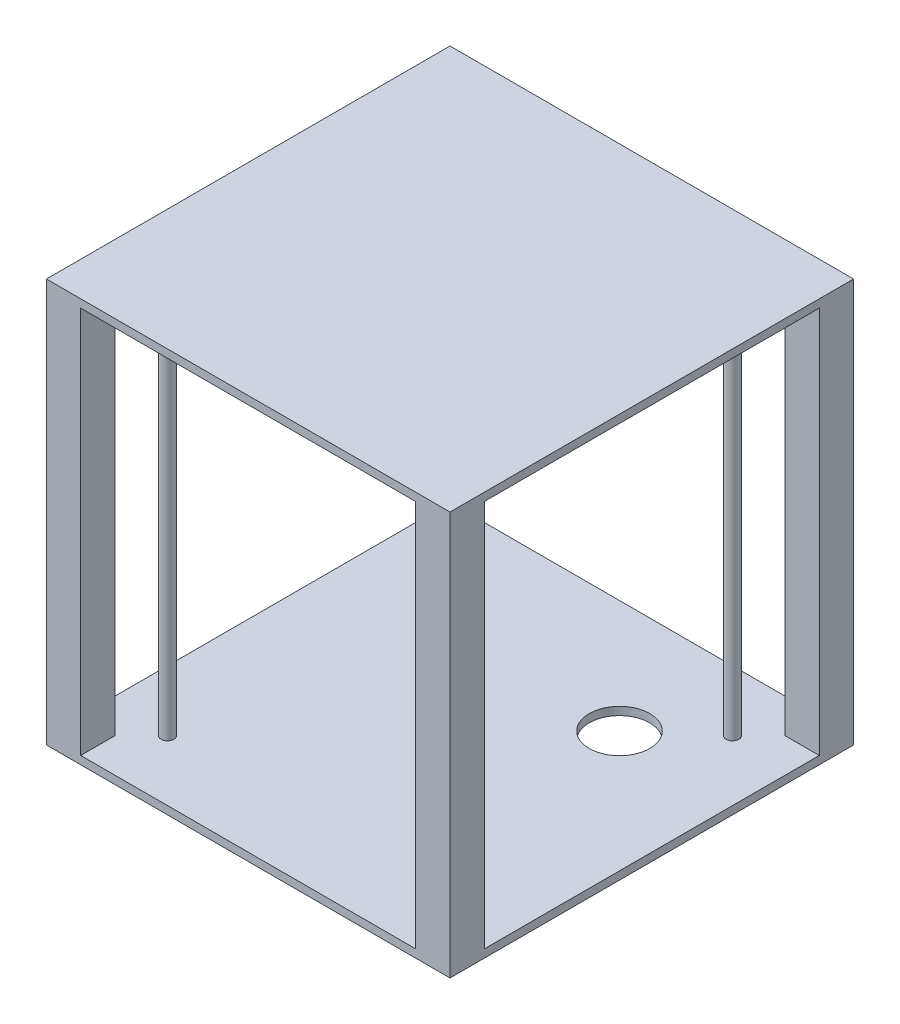
ISO-10303-21;
HEADER;
FILE_DESCRIPTION(('STEP AP214'),'2;1');
FILE_NAME('part.step','',(''),(''),'','','');
FILE_SCHEMA(('AUTOMOTIVE_DESIGN { 1 0 10303 214 1 1 1 1 }'));
ENDSEC;
DATA;
#1=APPLICATION_CONTEXT('core data for automotive mechanical design processes');
#2=APPLICATION_PROTOCOL_DEFINITION('international standard','automotive_design',2000,#1);
#3=PRODUCT_CONTEXT('',#1,'mechanical');
#4=PRODUCT('Part','Part','',(#3));
#5=PRODUCT_RELATED_PRODUCT_CATEGORY('part','',(#4));
#6=PRODUCT_DEFINITION_FORMATION('','',#4);
#7=PRODUCT_DEFINITION_CONTEXT('part definition',#1,'design');
#8=PRODUCT_DEFINITION('design','',#6,#7);
#9=PRODUCT_DEFINITION_SHAPE('','',#8);
#10=(LENGTH_UNIT() NAMED_UNIT(*) SI_UNIT(.MILLI.,.METRE.));
#11=(NAMED_UNIT(*) PLANE_ANGLE_UNIT() SI_UNIT($,.RADIAN.));
#12=(NAMED_UNIT(*) SI_UNIT($,.STERADIAN.) SOLID_ANGLE_UNIT());
#13=UNCERTAINTY_MEASURE_WITH_UNIT(LENGTH_MEASURE(1.E-05),#10,'distance_accuracy_value','');
#14=(GEOMETRIC_REPRESENTATION_CONTEXT(3) GLOBAL_UNCERTAINTY_ASSIGNED_CONTEXT((#13)) GLOBAL_UNIT_ASSIGNED_CONTEXT((#10,
#11,#12)) REPRESENTATION_CONTEXT('',''));
#15=CARTESIAN_POINT('',(0.,0.,0.));
#16=DIRECTION('',(0.,0.,1.));
#17=DIRECTION('',(1.,0.,0.));
#18=AXIS2_PLACEMENT_3D('',#15,#16,#17);
#19=CARTESIAN_POINT('',(0.,2.,0.));
#20=DIRECTION('',(0.,-1.,0.));
#21=DIRECTION('',(0.,0.,-1.));
#22=AXIS2_PLACEMENT_3D('',#19,#20,#21);
#23=PLANE('',#22);
#24=CARTESIAN_POINT('',(70.,2.,-72.));
#25=DIRECTION('',(0.,1.,0.));
#26=DIRECTION('',(0.,0.,1.));
#27=AXIS2_PLACEMENT_3D('',#24,#25,#26);
#28=CIRCLE('',#27,7.5);
#29=CARTESIAN_POINT('',(70.,2.,-64.5));
#30=VERTEX_POINT('',#29);
#31=EDGE_CURVE('E509',#30,#30,#28,.T.);
#32=ORIENTED_EDGE('',*,*,#31,.F.);
#33=EDGE_LOOP('',(#32));
#34=FACE_BOUND('',#33,.T.);
#35=CARTESIAN_POINT('',(85.,2.,-85.));
#36=DIRECTION('',(0.,-1.,0.));
#37=DIRECTION('',(0.,0.,-1.));
#38=AXIS2_PLACEMENT_3D('',#35,#36,#37);
#39=CIRCLE('',#38,1.575);
#40=CARTESIAN_POINT('',(85.,2.,-86.575));
#41=VERTEX_POINT('',#40);
#42=EDGE_CURVE('E372',#41,#41,#39,.F.);
#43=ORIENTED_EDGE('',*,*,#42,.F.);
#44=EDGE_LOOP('',(#43));
#45=FACE_BOUND('',#44,.T.);
#46=CARTESIAN_POINT('',(15.,2.,-85.));
#47=DIRECTION('',(0.,-1.,0.));
#48=DIRECTION('',(0.,0.,-1.));
#49=AXIS2_PLACEMENT_3D('',#46,#47,#48);
#50=CIRCLE('',#49,1.575);
#51=CARTESIAN_POINT('',(15.,2.,-86.575));
#52=VERTEX_POINT('',#51);
#53=EDGE_CURVE('E157',#52,#52,#50,.F.);
#54=ORIENTED_EDGE('',*,*,#53,.F.);
#55=EDGE_LOOP('',(#54));
#56=FACE_BOUND('',#55,.T.);
#57=DIRECTION('',(0.,0.,1.));
#58=VECTOR('',#57,1.);
#59=CARTESIAN_POINT('',(91.5,2.,-91.5));
#60=LINE('',#59,#58);
#61=CARTESIAN_POINT('',(91.5,2.,-100.));
#62=VERTEX_POINT('',#61);
#63=CARTESIAN_POINT('',(91.5,2.,-91.5));
#64=VERTEX_POINT('',#63);
#65=EDGE_CURVE('E184',#62,#64,#60,.T.);
#66=ORIENTED_EDGE('',*,*,#65,.F.);
#67=DIRECTION('',(-1.,0.,0.));
#68=VECTOR('',#67,1.);
#69=CARTESIAN_POINT('',(0.,2.,-100.));
#70=LINE('',#69,#68);
#71=CARTESIAN_POINT('',(8.5,2.,-100.));
#72=VERTEX_POINT('',#71);
#73=EDGE_CURVE('E326',#62,#72,#70,.T.);
#74=ORIENTED_EDGE('',*,*,#73,.T.);
#75=DIRECTION('',(0.,0.,-1.));
#76=VECTOR('',#75,1.);
#77=CARTESIAN_POINT('',(8.5,2.,-91.5));
#78=LINE('',#77,#76);
#79=CARTESIAN_POINT('',(8.5,2.,-91.5));
#80=VERTEX_POINT('',#79);
#81=EDGE_CURVE('E215',#80,#72,#78,.T.);
#82=ORIENTED_EDGE('',*,*,#81,.F.);
#83=DIRECTION('',(1.,0.,0.));
#84=VECTOR('',#83,1.);
#85=CARTESIAN_POINT('',(0.,2.,-91.5));
#86=LINE('',#85,#84);
#87=CARTESIAN_POINT('',(0.,2.,-91.5));
#88=VERTEX_POINT('',#87);
#89=EDGE_CURVE('E210',#88,#80,#86,.T.);
#90=ORIENTED_EDGE('',*,*,#89,.F.);
#91=DIRECTION('',(0.,0.,1.));
#92=VECTOR('',#91,1.);
#93=CARTESIAN_POINT('',(0.,2.,0.));
#94=LINE('',#93,#92);
#95=CARTESIAN_POINT('',(0.,2.,-8.5));
#96=VERTEX_POINT('',#95);
#97=EDGE_CURVE('E275',#88,#96,#94,.T.);
#98=ORIENTED_EDGE('',*,*,#97,.T.);
#99=DIRECTION('',(-1.,0.,0.));
#100=VECTOR('',#99,1.);
#101=CARTESIAN_POINT('',(0.,2.,-8.5));
#102=LINE('',#101,#100);
#103=CARTESIAN_POINT('',(8.5,2.,-8.5));
#104=VERTEX_POINT('',#103);
#105=EDGE_CURVE('E257',#104,#96,#102,.T.);
#106=ORIENTED_EDGE('',*,*,#105,.F.);
#107=DIRECTION('',(0.,0.,-1.));
#108=VECTOR('',#107,1.);
#109=CARTESIAN_POINT('',(8.5,2.,0.));
#110=LINE('',#109,#108);
#111=CARTESIAN_POINT('',(8.5,2.,0.));
#112=VERTEX_POINT('',#111);
#113=EDGE_CURVE('E252',#112,#104,#110,.T.);
#114=ORIENTED_EDGE('',*,*,#113,.F.);
#115=DIRECTION('',(1.,0.,0.));
#116=VECTOR('',#115,1.);
#117=CARTESIAN_POINT('',(0.,2.,0.));
#118=LINE('',#117,#116);
#119=CARTESIAN_POINT('',(91.5,2.,0.));
#120=VERTEX_POINT('',#119);
#121=EDGE_CURVE('E277',#112,#120,#118,.T.);
#122=ORIENTED_EDGE('',*,*,#121,.T.);
#123=DIRECTION('',(0.,0.,1.));
#124=VECTOR('',#123,1.);
#125=CARTESIAN_POINT('',(91.5,2.,0.));
#126=LINE('',#125,#124);
#127=CARTESIAN_POINT('',(91.5,2.,-8.5));
#128=VERTEX_POINT('',#127);
#129=EDGE_CURVE('E231',#128,#120,#126,.T.);
#130=ORIENTED_EDGE('',*,*,#129,.F.);
#131=DIRECTION('',(-1.,0.,0.));
#132=VECTOR('',#131,1.);
#133=CARTESIAN_POINT('',(91.5,2.,-8.5));
#134=LINE('',#133,#132);
#135=CARTESIAN_POINT('',(100.,2.,-8.5));
#136=VERTEX_POINT('',#135);
#137=EDGE_CURVE('E236',#136,#128,#134,.T.);
#138=ORIENTED_EDGE('',*,*,#137,.F.);
#139=DIRECTION('',(0.,0.,-1.));
#140=VECTOR('',#139,1.);
#141=CARTESIAN_POINT('',(100.,2.,0.));
#142=LINE('',#141,#140);
#143=CARTESIAN_POINT('',(100.,2.,-91.5));
#144=VERTEX_POINT('',#143);
#145=EDGE_CURVE('E54',#136,#144,#142,.T.);
#146=ORIENTED_EDGE('',*,*,#145,.T.);
#147=DIRECTION('',(1.,0.,0.));
#148=VECTOR('',#147,1.);
#149=CARTESIAN_POINT('',(91.5,2.,-91.5));
#150=LINE('',#149,#148);
#151=EDGE_CURVE('E49',#64,#144,#150,.T.);
#152=ORIENTED_EDGE('',*,*,#151,.F.);
#153=EDGE_LOOP('',(#66,#74,#82,#90,#98,#106,#114,#122,#130,#138,#146,#152));
#154=FACE_BOUND('',#153,.T.);
#155=CARTESIAN_POINT('',(15.,2.,-15.));
#156=DIRECTION('',(0.,-1.,0.));
#157=DIRECTION('',(0.,0.,-1.));
#158=AXIS2_PLACEMENT_3D('',#155,#156,#157);
#159=CIRCLE('',#158,1.575);
#160=CARTESIAN_POINT('',(15.,2.,-16.575));
#161=VERTEX_POINT('',#160);
#162=EDGE_CURVE('E368',#161,#161,#159,.F.);
#163=ORIENTED_EDGE('',*,*,#162,.F.);
#164=EDGE_LOOP('',(#163));
#165=FACE_BOUND('',#164,.T.);
#166=CARTESIAN_POINT('',(85.,2.,-15.));
#167=DIRECTION('',(0.,-1.,0.));
#168=DIRECTION('',(0.,0.,-1.));
#169=AXIS2_PLACEMENT_3D('',#166,#167,#168);
#170=CIRCLE('',#169,1.575);
#171=CARTESIAN_POINT('',(85.,2.,-16.575));
#172=VERTEX_POINT('',#171);
#173=EDGE_CURVE('E11',#172,#172,#170,.F.);
#174=ORIENTED_EDGE('',*,*,#173,.F.);
#175=EDGE_LOOP('',(#174));
#176=FACE_BOUND('',#175,.T.);
#177=ADVANCED_FACE('F33',(#34,#45,#56,#154,#165,#176),#23,.F.);
#178=CARTESIAN_POINT('',(0.,2.,0.));
#179=DIRECTION('',(1.,0.,0.));
#180=DIRECTION('',(0.,0.,-1.));
#181=AXIS2_PLACEMENT_3D('',#178,#179,#180);
#182=PLANE('',#181);
#183=DIRECTION('',(0.,-1.,0.));
#184=VECTOR('',#183,1.);
#185=CARTESIAN_POINT('',(0.,2.,0.));
#186=LINE('',#185,#184);
#187=CARTESIAN_POINT('',(0.,100.,0.));
#188=VERTEX_POINT('',#187);
#189=CARTESIAN_POINT('',(0.,0.,0.));
#190=VERTEX_POINT('',#189);
#191=EDGE_CURVE('E147',#188,#190,#186,.T.);
#192=ORIENTED_EDGE('',*,*,#191,.F.);
#193=DIRECTION('',(0.,0.,1.));
#194=VECTOR('',#193,1.);
#195=CARTESIAN_POINT('',(0.,100.,0.));
#196=LINE('',#195,#194);
#197=CARTESIAN_POINT('',(0.,100.,-100.));
#198=VERTEX_POINT('',#197);
#199=EDGE_CURVE('E153',#198,#188,#196,.T.);
#200=ORIENTED_EDGE('',*,*,#199,.F.);
#201=DIRECTION('',(0.,-1.,0.));
#202=VECTOR('',#201,1.);
#203=CARTESIAN_POINT('',(0.,2.,-100.));
#204=LINE('',#203,#202);
#205=CARTESIAN_POINT('',(0.,0.,-100.));
#206=VERTEX_POINT('',#205);
#207=EDGE_CURVE('E328',#198,#206,#204,.T.);
#208=ORIENTED_EDGE('',*,*,#207,.T.);
#209=DIRECTION('',(0.,0.,1.));
#210=VECTOR('',#209,1.);
#211=CARTESIAN_POINT('',(0.,0.,0.));
#212=LINE('',#211,#210);
#213=EDGE_CURVE('E155',#206,#190,#212,.T.);
#214=ORIENTED_EDGE('',*,*,#213,.T.);
#215=EDGE_LOOP('',(#192,#200,#208,#214));
#216=FACE_BOUND('',#215,.T.);
#217=DIRECTION('',(0.,0.,1.));
#218=VECTOR('',#217,1.);
#219=CARTESIAN_POINT('',(0.,98.,0.));
#220=LINE('',#219,#218);
#221=CARTESIAN_POINT('',(0.,98.,-91.5));
#222=VERTEX_POINT('',#221);
#223=CARTESIAN_POINT('',(0.,98.,-8.5));
#224=VERTEX_POINT('',#223);
#225=EDGE_CURVE('E185',#222,#224,#220,.T.);
#226=ORIENTED_EDGE('',*,*,#225,.T.);
#227=DIRECTION('',(0.,-1.,0.));
#228=VECTOR('',#227,1.);
#229=CARTESIAN_POINT('',(0.,98.,-8.5));
#230=LINE('',#229,#228);
#231=EDGE_CURVE('E260',#224,#96,#230,.T.);
#232=ORIENTED_EDGE('',*,*,#231,.T.);
#233=ORIENTED_EDGE('',*,*,#97,.F.);
#234=DIRECTION('',(0.,-1.,0.));
#235=VECTOR('',#234,1.);
#236=CARTESIAN_POINT('',(0.,98.,-91.5));
#237=LINE('',#236,#235);
#238=EDGE_CURVE('E228',#222,#88,#237,.T.);
#239=ORIENTED_EDGE('',*,*,#238,.F.);
#240=EDGE_LOOP('',(#226,#232,#233,#239));
#241=FACE_BOUND('',#240,.T.);
#242=ADVANCED_FACE('F149',(#216,#241),#182,.F.);
#243=CARTESIAN_POINT('',(0.,2.,0.));
#244=DIRECTION('',(0.,0.,-1.));
#245=DIRECTION('',(-1.,0.,0.));
#246=AXIS2_PLACEMENT_3D('',#243,#244,#245);
#247=PLANE('',#246);
#248=DIRECTION('',(0.,-1.,0.));
#249=VECTOR('',#248,1.);
#250=CARTESIAN_POINT('',(8.5,98.,0.));
#251=LINE('',#250,#249);
#252=CARTESIAN_POINT('',(8.5,98.,0.));
#253=VERTEX_POINT('',#252);
#254=EDGE_CURVE('E291',#253,#112,#251,.T.);
#255=ORIENTED_EDGE('',*,*,#254,.F.);
#256=DIRECTION('',(1.,0.,0.));
#257=VECTOR('',#256,1.);
#258=CARTESIAN_POINT('',(0.,98.,0.));
#259=LINE('',#258,#257);
#260=CARTESIAN_POINT('',(91.5,98.,0.));
#261=VERTEX_POINT('',#260);
#262=EDGE_CURVE('E188',#253,#261,#259,.T.);
#263=ORIENTED_EDGE('',*,*,#262,.T.);
#264=DIRECTION('',(0.,-1.,0.));
#265=VECTOR('',#264,1.);
#266=CARTESIAN_POINT('',(91.5,98.,0.));
#267=LINE('',#266,#265);
#268=EDGE_CURVE('E249',#261,#120,#267,.T.);
#269=ORIENTED_EDGE('',*,*,#268,.T.);
#270=ORIENTED_EDGE('',*,*,#121,.F.);
#271=EDGE_LOOP('',(#255,#263,#269,#270));
#272=FACE_BOUND('',#271,.T.);
#273=DIRECTION('',(1.,0.,0.));
#274=VECTOR('',#273,1.);
#275=CARTESIAN_POINT('',(0.,0.,0.));
#276=LINE('',#275,#274);
#277=CARTESIAN_POINT('',(100.,0.,0.));
#278=VERTEX_POINT('',#277);
#279=EDGE_CURVE('E295',#190,#278,#276,.T.);
#280=ORIENTED_EDGE('',*,*,#279,.T.);
#281=DIRECTION('',(0.,-1.,0.));
#282=VECTOR('',#281,1.);
#283=CARTESIAN_POINT('',(100.,2.,0.));
#284=LINE('',#283,#282);
#285=CARTESIAN_POINT('',(100.,100.,0.));
#286=VERTEX_POINT('',#285);
#287=EDGE_CURVE('E158',#286,#278,#284,.T.);
#288=ORIENTED_EDGE('',*,*,#287,.F.);
#289=DIRECTION('',(1.,0.,0.));
#290=VECTOR('',#289,1.);
#291=CARTESIAN_POINT('',(0.,100.,0.));
#292=LINE('',#291,#290);
#293=EDGE_CURVE('E161',#188,#286,#292,.T.);
#294=ORIENTED_EDGE('',*,*,#293,.F.);
#295=ORIENTED_EDGE('',*,*,#191,.T.);
#296=EDGE_LOOP('',(#280,#288,#294,#295));
#297=FACE_BOUND('',#296,.T.);
#298=ADVANCED_FACE('F162',(#272,#297),#247,.F.);
#299=CARTESIAN_POINT('',(100.,2.,0.));
#300=DIRECTION('',(-1.,0.,0.));
#301=DIRECTION('',(0.,0.,1.));
#302=AXIS2_PLACEMENT_3D('',#299,#300,#301);
#303=PLANE('',#302);
#304=DIRECTION('',(0.,-1.,0.));
#305=VECTOR('',#304,1.);
#306=CARTESIAN_POINT('',(100.,98.,-8.5));
#307=LINE('',#306,#305);
#308=CARTESIAN_POINT('',(100.,98.,-8.5));
#309=VERTEX_POINT('',#308);
#310=EDGE_CURVE('E246',#309,#136,#307,.T.);
#311=ORIENTED_EDGE('',*,*,#310,.F.);
#312=DIRECTION('',(0.,0.,-1.));
#313=VECTOR('',#312,1.);
#314=CARTESIAN_POINT('',(100.,98.,0.));
#315=LINE('',#314,#313);
#316=CARTESIAN_POINT('',(100.,98.,-91.5));
#317=VERTEX_POINT('',#316);
#318=EDGE_CURVE('E176',#309,#317,#315,.T.);
#319=ORIENTED_EDGE('',*,*,#318,.T.);
#320=DIRECTION('',(0.,-1.,0.));
#321=VECTOR('',#320,1.);
#322=CARTESIAN_POINT('',(100.,98.,-91.5));
#323=LINE('',#322,#321);
#324=EDGE_CURVE('E205',#317,#144,#323,.T.);
#325=ORIENTED_EDGE('',*,*,#324,.T.);
#326=ORIENTED_EDGE('',*,*,#145,.F.);
#327=EDGE_LOOP('',(#311,#319,#325,#326));
#328=FACE_BOUND('',#327,.T.);
#329=DIRECTION('',(0.,0.,-1.));
#330=VECTOR('',#329,1.);
#331=CARTESIAN_POINT('',(100.,0.,0.));
#332=LINE('',#331,#330);
#333=CARTESIAN_POINT('',(100.,0.,-100.));
#334=VERTEX_POINT('',#333);
#335=EDGE_CURVE('E520',#278,#334,#332,.T.);
#336=ORIENTED_EDGE('',*,*,#335,.T.);
#337=DIRECTION('',(0.,-1.,0.));
#338=VECTOR('',#337,1.);
#339=CARTESIAN_POINT('',(100.,2.,-100.));
#340=LINE('',#339,#338);
#341=CARTESIAN_POINT('',(100.,100.,-100.));
#342=VERTEX_POINT('',#341);
#343=EDGE_CURVE('E526',#342,#334,#340,.T.);
#344=ORIENTED_EDGE('',*,*,#343,.F.);
#345=DIRECTION('',(0.,0.,-1.));
#346=VECTOR('',#345,1.);
#347=CARTESIAN_POINT('',(100.,100.,0.));
#348=LINE('',#347,#346);
#349=EDGE_CURVE('E167',#286,#342,#348,.T.);
#350=ORIENTED_EDGE('',*,*,#349,.F.);
#351=ORIENTED_EDGE('',*,*,#287,.T.);
#352=EDGE_LOOP('',(#336,#344,#350,#351));
#353=FACE_BOUND('',#352,.T.);
#354=ADVANCED_FACE('F314',(#328,#353),#303,.F.);
#355=CARTESIAN_POINT('',(0.,2.,-100.));
#356=DIRECTION('',(0.,0.,1.));
#357=DIRECTION('',(1.,0.,0.));
#358=AXIS2_PLACEMENT_3D('',#355,#356,#357);
#359=PLANE('',#358);
#360=ORIENTED_EDGE('',*,*,#207,.F.);
#361=DIRECTION('',(-1.,0.,0.));
#362=VECTOR('',#361,1.);
#363=CARTESIAN_POINT('',(0.,100.,-100.));
#364=LINE('',#363,#362);
#365=EDGE_CURVE('E172',#342,#198,#364,.T.);
#366=ORIENTED_EDGE('',*,*,#365,.F.);
#367=ORIENTED_EDGE('',*,*,#343,.T.);
#368=DIRECTION('',(-1.,0.,0.));
#369=VECTOR('',#368,1.);
#370=CARTESIAN_POINT('',(0.,0.,-100.));
#371=LINE('',#370,#369);
#372=EDGE_CURVE('E278',#334,#206,#371,.T.);
#373=ORIENTED_EDGE('',*,*,#372,.T.);
#374=EDGE_LOOP('',(#360,#366,#367,#373));
#375=FACE_BOUND('',#374,.T.);
#376=DIRECTION('',(-1.,0.,0.));
#377=VECTOR('',#376,1.);
#378=CARTESIAN_POINT('',(0.,98.,-100.));
#379=LINE('',#378,#377);
#380=CARTESIAN_POINT('',(91.5,98.,-100.));
#381=VERTEX_POINT('',#380);
#382=CARTESIAN_POINT('',(8.5,98.,-100.));
#383=VERTEX_POINT('',#382);
#384=EDGE_CURVE('E173',#381,#383,#379,.T.);
#385=ORIENTED_EDGE('',*,*,#384,.T.);
#386=DIRECTION('',(0.,-1.,0.));
#387=VECTOR('',#386,1.);
#388=CARTESIAN_POINT('',(8.5,98.,-100.));
#389=LINE('',#388,#387);
#390=EDGE_CURVE('E218',#383,#72,#389,.T.);
#391=ORIENTED_EDGE('',*,*,#390,.T.);
#392=ORIENTED_EDGE('',*,*,#73,.F.);
#393=DIRECTION('',(0.,-1.,0.));
#394=VECTOR('',#393,1.);
#395=CARTESIAN_POINT('',(91.5,98.,-100.));
#396=LINE('',#395,#394);
#397=EDGE_CURVE('E199',#381,#62,#396,.T.);
#398=ORIENTED_EDGE('',*,*,#397,.F.);
#399=EDGE_LOOP('',(#385,#391,#392,#398));
#400=FACE_BOUND('',#399,.T.);
#401=ADVANCED_FACE('F332',(#375,#400),#359,.F.);
#402=CARTESIAN_POINT('',(0.,0.,0.));
#403=DIRECTION('',(0.,-1.,0.));
#404=DIRECTION('',(0.,0.,-1.));
#405=AXIS2_PLACEMENT_3D('',#402,#403,#404);
#406=PLANE('',#405);
#407=CARTESIAN_POINT('',(70.,0.,-72.));
#408=DIRECTION('',(0.,-1.,0.));
#409=DIRECTION('',(0.,0.,-1.));
#410=AXIS2_PLACEMENT_3D('',#407,#408,#409);
#411=CIRCLE('',#410,7.5);
#412=CARTESIAN_POINT('',(70.,0.,-79.5));
#413=VERTEX_POINT('',#412);
#414=EDGE_CURVE('E37',#413,#413,#411,.T.);
#415=ORIENTED_EDGE('',*,*,#414,.F.);
#416=EDGE_LOOP('',(#415));
#417=FACE_BOUND('',#416,.T.);
#418=ORIENTED_EDGE('',*,*,#213,.F.);
#419=ORIENTED_EDGE('',*,*,#372,.F.);
#420=ORIENTED_EDGE('',*,*,#335,.F.);
#421=ORIENTED_EDGE('',*,*,#279,.F.);
#422=EDGE_LOOP('',(#418,#419,#420,#421));
#423=FACE_BOUND('',#422,.T.);
#424=ADVANCED_FACE('F409',(#417,#423),#406,.T.);
#425=CARTESIAN_POINT('',(8.5,98.,0.));
#426=DIRECTION('',(-1.,0.,0.));
#427=DIRECTION('',(0.,0.,1.));
#428=AXIS2_PLACEMENT_3D('',#425,#426,#427);
#429=PLANE('',#428);
#430=ORIENTED_EDGE('',*,*,#113,.T.);
#431=DIRECTION('',(0.,-1.,0.));
#432=VECTOR('',#431,1.);
#433=CARTESIAN_POINT('',(8.5,98.,-8.5));
#434=LINE('',#433,#432);
#435=CARTESIAN_POINT('',(8.5,98.,-8.5));
#436=VERTEX_POINT('',#435);
#437=EDGE_CURVE('E263',#436,#104,#434,.T.);
#438=ORIENTED_EDGE('',*,*,#437,.F.);
#439=DIRECTION('',(0.,0.,-1.));
#440=VECTOR('',#439,1.);
#441=CARTESIAN_POINT('',(8.5,98.,0.));
#442=LINE('',#441,#440);
#443=EDGE_CURVE('E253',#253,#436,#442,.T.);
#444=ORIENTED_EDGE('',*,*,#443,.F.);
#445=ORIENTED_EDGE('',*,*,#254,.T.);
#446=EDGE_LOOP('',(#430,#438,#444,#445));
#447=FACE_BOUND('',#446,.T.);
#448=ADVANCED_FACE('F301',(#447),#429,.F.);
#449=CARTESIAN_POINT('',(0.,98.,-8.5));
#450=DIRECTION('',(0.,0.,1.));
#451=DIRECTION('',(1.,0.,0.));
#452=AXIS2_PLACEMENT_3D('',#449,#450,#451);
#453=PLANE('',#452);
#454=ORIENTED_EDGE('',*,*,#105,.T.);
#455=ORIENTED_EDGE('',*,*,#231,.F.);
#456=DIRECTION('',(-1.,0.,0.));
#457=VECTOR('',#456,1.);
#458=CARTESIAN_POINT('',(0.,98.,-8.5));
#459=LINE('',#458,#457);
#460=EDGE_CURVE('E256',#436,#224,#459,.T.);
#461=ORIENTED_EDGE('',*,*,#460,.F.);
#462=ORIENTED_EDGE('',*,*,#437,.T.);
#463=EDGE_LOOP('',(#454,#455,#461,#462));
#464=FACE_BOUND('',#463,.T.);
#465=ADVANCED_FACE('F300',(#464),#453,.F.);
#466=CARTESIAN_POINT('',(91.5,98.,0.));
#467=DIRECTION('',(1.,0.,0.));
#468=DIRECTION('',(0.,0.,-1.));
#469=AXIS2_PLACEMENT_3D('',#466,#467,#468);
#470=PLANE('',#469);
#471=ORIENTED_EDGE('',*,*,#129,.T.);
#472=ORIENTED_EDGE('',*,*,#268,.F.);
#473=DIRECTION('',(0.,0.,1.));
#474=VECTOR('',#473,1.);
#475=CARTESIAN_POINT('',(91.5,98.,0.));
#476=LINE('',#475,#474);
#477=CARTESIAN_POINT('',(91.5,98.,-8.5));
#478=VERTEX_POINT('',#477);
#479=EDGE_CURVE('E232',#478,#261,#476,.T.);
#480=ORIENTED_EDGE('',*,*,#479,.F.);
#481=DIRECTION('',(0.,-1.,0.));
#482=VECTOR('',#481,1.);
#483=CARTESIAN_POINT('',(91.5,98.,-8.5));
#484=LINE('',#483,#482);
#485=EDGE_CURVE('E239',#478,#128,#484,.T.);
#486=ORIENTED_EDGE('',*,*,#485,.T.);
#487=EDGE_LOOP('',(#471,#472,#480,#486));
#488=FACE_BOUND('',#487,.T.);
#489=ADVANCED_FACE('F308',(#488),#470,.F.);
#490=CARTESIAN_POINT('',(91.5,98.,-8.5));
#491=DIRECTION('',(0.,0.,1.));
#492=DIRECTION('',(1.,0.,0.));
#493=AXIS2_PLACEMENT_3D('',#490,#491,#492);
#494=PLANE('',#493);
#495=ORIENTED_EDGE('',*,*,#137,.T.);
#496=ORIENTED_EDGE('',*,*,#485,.F.);
#497=DIRECTION('',(-1.,0.,0.));
#498=VECTOR('',#497,1.);
#499=CARTESIAN_POINT('',(91.5,98.,-8.5));
#500=LINE('',#499,#498);
#501=EDGE_CURVE('E235',#309,#478,#500,.T.);
#502=ORIENTED_EDGE('',*,*,#501,.F.);
#503=ORIENTED_EDGE('',*,*,#310,.T.);
#504=EDGE_LOOP('',(#495,#496,#502,#503));
#505=FACE_BOUND('',#504,.T.);
#506=ADVANCED_FACE('F310',(#505),#494,.F.);
#507=CARTESIAN_POINT('',(0.,98.,-91.5));
#508=DIRECTION('',(0.,0.,-1.));
#509=DIRECTION('',(-1.,0.,0.));
#510=AXIS2_PLACEMENT_3D('',#507,#508,#509);
#511=PLANE('',#510);
#512=ORIENTED_EDGE('',*,*,#89,.T.);
#513=DIRECTION('',(0.,-1.,0.));
#514=VECTOR('',#513,1.);
#515=CARTESIAN_POINT('',(8.5,98.,-91.5));
#516=LINE('',#515,#514);
#517=CARTESIAN_POINT('',(8.5,98.,-91.5));
#518=VERTEX_POINT('',#517);
#519=EDGE_CURVE('E225',#518,#80,#516,.T.);
#520=ORIENTED_EDGE('',*,*,#519,.F.);
#521=DIRECTION('',(1.,0.,0.));
#522=VECTOR('',#521,1.);
#523=CARTESIAN_POINT('',(0.,98.,-91.5));
#524=LINE('',#523,#522);
#525=EDGE_CURVE('E211',#222,#518,#524,.T.);
#526=ORIENTED_EDGE('',*,*,#525,.F.);
#527=ORIENTED_EDGE('',*,*,#238,.T.);
#528=EDGE_LOOP('',(#512,#520,#526,#527));
#529=FACE_BOUND('',#528,.T.);
#530=ADVANCED_FACE('F336',(#529),#511,.F.);
#531=CARTESIAN_POINT('',(8.5,98.,-91.5));
#532=DIRECTION('',(-1.,0.,0.));
#533=DIRECTION('',(0.,0.,1.));
#534=AXIS2_PLACEMENT_3D('',#531,#532,#533);
#535=PLANE('',#534);
#536=ORIENTED_EDGE('',*,*,#81,.T.);
#537=ORIENTED_EDGE('',*,*,#390,.F.);
#538=DIRECTION('',(0.,0.,-1.));
#539=VECTOR('',#538,1.);
#540=CARTESIAN_POINT('',(8.5,98.,-91.5));
#541=LINE('',#540,#539);
#542=EDGE_CURVE('E214',#518,#383,#541,.T.);
#543=ORIENTED_EDGE('',*,*,#542,.F.);
#544=ORIENTED_EDGE('',*,*,#519,.T.);
#545=EDGE_LOOP('',(#536,#537,#543,#544));
#546=FACE_BOUND('',#545,.T.);
#547=ADVANCED_FACE('F330',(#546),#535,.F.);
#548=CARTESIAN_POINT('',(91.5,98.,-91.5));
#549=DIRECTION('',(1.,0.,0.));
#550=DIRECTION('',(0.,0.,-1.));
#551=AXIS2_PLACEMENT_3D('',#548,#549,#550);
#552=PLANE('',#551);
#553=ORIENTED_EDGE('',*,*,#65,.T.);
#554=DIRECTION('',(0.,-1.,0.));
#555=VECTOR('',#554,1.);
#556=CARTESIAN_POINT('',(91.5,98.,-91.5));
#557=LINE('',#556,#555);
#558=CARTESIAN_POINT('',(91.5,98.,-91.5));
#559=VERTEX_POINT('',#558);
#560=EDGE_CURVE('E208',#559,#64,#557,.T.);
#561=ORIENTED_EDGE('',*,*,#560,.F.);
#562=DIRECTION('',(0.,0.,1.));
#563=VECTOR('',#562,1.);
#564=CARTESIAN_POINT('',(91.5,98.,-91.5));
#565=LINE('',#564,#563);
#566=EDGE_CURVE('E193',#381,#559,#565,.T.);
#567=ORIENTED_EDGE('',*,*,#566,.F.);
#568=ORIENTED_EDGE('',*,*,#397,.T.);
#569=EDGE_LOOP('',(#553,#561,#567,#568));
#570=FACE_BOUND('',#569,.T.);
#571=ADVANCED_FACE('F324',(#570),#552,.F.);
#572=CARTESIAN_POINT('',(91.5,98.,-91.5));
#573=DIRECTION('',(0.,0.,-1.));
#574=DIRECTION('',(-1.,0.,0.));
#575=AXIS2_PLACEMENT_3D('',#572,#573,#574);
#576=PLANE('',#575);
#577=ORIENTED_EDGE('',*,*,#151,.T.);
#578=ORIENTED_EDGE('',*,*,#324,.F.);
#579=DIRECTION('',(1.,0.,0.));
#580=VECTOR('',#579,1.);
#581=CARTESIAN_POINT('',(91.5,98.,-91.5));
#582=LINE('',#581,#580);
#583=EDGE_CURVE('E196',#559,#317,#582,.T.);
#584=ORIENTED_EDGE('',*,*,#583,.F.);
#585=ORIENTED_EDGE('',*,*,#560,.T.);
#586=EDGE_LOOP('',(#577,#578,#584,#585));
#587=FACE_BOUND('',#586,.T.);
#588=ADVANCED_FACE('F322',(#587),#576,.F.);
#589=CARTESIAN_POINT('',(0.,98.,0.));
#590=DIRECTION('',(0.,-1.,0.));
#591=DIRECTION('',(0.,0.,-1.));
#592=AXIS2_PLACEMENT_3D('',#589,#590,#591);
#593=PLANE('',#592);
#594=CARTESIAN_POINT('',(85.,98.,-85.));
#595=DIRECTION('',(0.,1.,0.));
#596=DIRECTION('',(0.,0.,1.));
#597=AXIS2_PLACEMENT_3D('',#594,#595,#596);
#598=CIRCLE('',#597,1.575);
#599=CARTESIAN_POINT('',(85.,98.,-83.425));
#600=VERTEX_POINT('',#599);
#601=EDGE_CURVE('E511',#600,#600,#598,.T.);
#602=ORIENTED_EDGE('',*,*,#601,.T.);
#603=EDGE_LOOP('',(#602));
#604=FACE_BOUND('',#603,.T.);
#605=CARTESIAN_POINT('',(15.,98.,-85.));
#606=DIRECTION('',(0.,1.,0.));
#607=DIRECTION('',(0.,0.,1.));
#608=AXIS2_PLACEMENT_3D('',#605,#606,#607);
#609=CIRCLE('',#608,1.575);
#610=CARTESIAN_POINT('',(15.,98.,-83.425));
#611=VERTEX_POINT('',#610);
#612=EDGE_CURVE('E179',#611,#611,#609,.T.);
#613=ORIENTED_EDGE('',*,*,#612,.T.);
#614=EDGE_LOOP('',(#613));
#615=FACE_BOUND('',#614,.T.);
#616=ORIENTED_EDGE('',*,*,#443,.T.);
#617=ORIENTED_EDGE('',*,*,#460,.T.);
#618=ORIENTED_EDGE('',*,*,#225,.F.);
#619=ORIENTED_EDGE('',*,*,#525,.T.);
#620=ORIENTED_EDGE('',*,*,#542,.T.);
#621=ORIENTED_EDGE('',*,*,#384,.F.);
#622=ORIENTED_EDGE('',*,*,#566,.T.);
#623=ORIENTED_EDGE('',*,*,#583,.T.);
#624=ORIENTED_EDGE('',*,*,#318,.F.);
#625=ORIENTED_EDGE('',*,*,#501,.T.);
#626=ORIENTED_EDGE('',*,*,#479,.T.);
#627=ORIENTED_EDGE('',*,*,#262,.F.);
#628=EDGE_LOOP('',(#616,#617,#618,#619,#620,#621,#622,#623,#624,#625,#626,#627));
#629=FACE_BOUND('',#628,.T.);
#630=CARTESIAN_POINT('',(15.,98.,-15.));
#631=DIRECTION('',(0.,1.,0.));
#632=DIRECTION('',(0.,0.,1.));
#633=AXIS2_PLACEMENT_3D('',#630,#631,#632);
#634=CIRCLE('',#633,1.575);
#635=CARTESIAN_POINT('',(15.,98.,-13.425));
#636=VERTEX_POINT('',#635);
#637=EDGE_CURVE('E365',#636,#636,#634,.T.);
#638=ORIENTED_EDGE('',*,*,#637,.T.);
#639=EDGE_LOOP('',(#638));
#640=FACE_BOUND('',#639,.T.);
#641=CARTESIAN_POINT('',(85.,98.,-15.));
#642=DIRECTION('',(0.,1.,0.));
#643=DIRECTION('',(0.,0.,1.));
#644=AXIS2_PLACEMENT_3D('',#641,#642,#643);
#645=CIRCLE('',#644,1.575);
#646=CARTESIAN_POINT('',(85.,98.,-13.425));
#647=VERTEX_POINT('',#646);
#648=EDGE_CURVE('E42',#647,#647,#645,.T.);
#649=ORIENTED_EDGE('',*,*,#648,.T.);
#650=EDGE_LOOP('',(#649));
#651=FACE_BOUND('',#650,.T.);
#652=ADVANCED_FACE('F317',(#604,#615,#629,#640,#651),#593,.T.);
#653=CARTESIAN_POINT('',(0.,100.,0.));
#654=DIRECTION('',(0.,-1.,0.));
#655=DIRECTION('',(0.,0.,-1.));
#656=AXIS2_PLACEMENT_3D('',#653,#654,#655);
#657=PLANE('',#656);
#658=ORIENTED_EDGE('',*,*,#199,.T.);
#659=ORIENTED_EDGE('',*,*,#293,.T.);
#660=ORIENTED_EDGE('',*,*,#349,.T.);
#661=ORIENTED_EDGE('',*,*,#365,.T.);
#662=EDGE_LOOP('',(#658,#659,#660,#661));
#663=FACE_BOUND('',#662,.T.);
#664=ADVANCED_FACE('F170',(#663),#657,.F.);
#665=CARTESIAN_POINT('',(15.,98.,-85.));
#666=DIRECTION('',(0.,-1.,0.));
#667=DIRECTION('',(0.,0.,-1.));
#668=AXIS2_PLACEMENT_3D('',#665,#666,#667);
#669=CYLINDRICAL_SURFACE('',#668,1.575);
#670=ORIENTED_EDGE('',*,*,#612,.F.);
#671=EDGE_LOOP('',(#670));
#672=FACE_BOUND('',#671,.T.);
#673=ORIENTED_EDGE('',*,*,#53,.T.);
#674=EDGE_LOOP('',(#673));
#675=FACE_BOUND('',#674,.T.);
#676=ADVANCED_FACE('F359',(#672,#675),#669,.T.);
#677=CARTESIAN_POINT('',(85.,98.,-85.));
#678=DIRECTION('',(0.,-1.,0.));
#679=DIRECTION('',(0.,0.,-1.));
#680=AXIS2_PLACEMENT_3D('',#677,#678,#679);
#681=CYLINDRICAL_SURFACE('',#680,1.575);
#682=ORIENTED_EDGE('',*,*,#601,.F.);
#683=EDGE_LOOP('',(#682));
#684=FACE_BOUND('',#683,.T.);
#685=ORIENTED_EDGE('',*,*,#42,.T.);
#686=EDGE_LOOP('',(#685));
#687=FACE_BOUND('',#686,.T.);
#688=ADVANCED_FACE('F351',(#684,#687),#681,.T.);
#689=CARTESIAN_POINT('',(15.,98.,-15.));
#690=DIRECTION('',(0.,-1.,0.));
#691=DIRECTION('',(0.,0.,-1.));
#692=AXIS2_PLACEMENT_3D('',#689,#690,#691);
#693=CYLINDRICAL_SURFACE('',#692,1.575);
#694=ORIENTED_EDGE('',*,*,#637,.F.);
#695=EDGE_LOOP('',(#694));
#696=FACE_BOUND('',#695,.T.);
#697=ORIENTED_EDGE('',*,*,#162,.T.);
#698=EDGE_LOOP('',(#697));
#699=FACE_BOUND('',#698,.T.);
#700=ADVANCED_FACE('F349',(#696,#699),#693,.T.);
#701=CARTESIAN_POINT('',(85.,98.,-15.));
#702=DIRECTION('',(0.,-1.,0.));
#703=DIRECTION('',(0.,0.,-1.));
#704=AXIS2_PLACEMENT_3D('',#701,#702,#703);
#705=CYLINDRICAL_SURFACE('',#704,1.575);
#706=ORIENTED_EDGE('',*,*,#648,.F.);
#707=EDGE_LOOP('',(#706));
#708=FACE_BOUND('',#707,.T.);
#709=ORIENTED_EDGE('',*,*,#173,.T.);
#710=EDGE_LOOP('',(#709));
#711=FACE_BOUND('',#710,.T.);
#712=ADVANCED_FACE('F35',(#708,#711),#705,.T.);
#713=CARTESIAN_POINT('',(70.,-8.,-72.));
#714=DIRECTION('',(0.,1.,0.));
#715=DIRECTION('',(0.,0.,1.));
#716=AXIS2_PLACEMENT_3D('',#713,#714,#715);
#717=CYLINDRICAL_SURFACE('',#716,7.5);
#718=ORIENTED_EDGE('',*,*,#414,.T.);
#719=EDGE_LOOP('',(#718));
#720=FACE_BOUND('',#719,.T.);
#721=ORIENTED_EDGE('',*,*,#31,.T.);
#722=EDGE_LOOP('',(#721));
#723=FACE_BOUND('',#722,.T.);
#724=ADVANCED_FACE('F357',(#720,#723),#717,.F.);
#725=CLOSED_SHELL('',(#177,#242,#298,#354,#401,#424,#448,#465,#489,#506,#530,#547,#571,#588,
#652,#664,#676,#688,#700,#712,#724));
#726=MANIFOLD_SOLID_BREP('B2',#725);
#727=ADVANCED_BREP_SHAPE_REPRESENTATION('',(#18,#726),#14);
#728=SHAPE_DEFINITION_REPRESENTATION(#9,#727);
ENDSEC;
END-ISO-10303-21;
